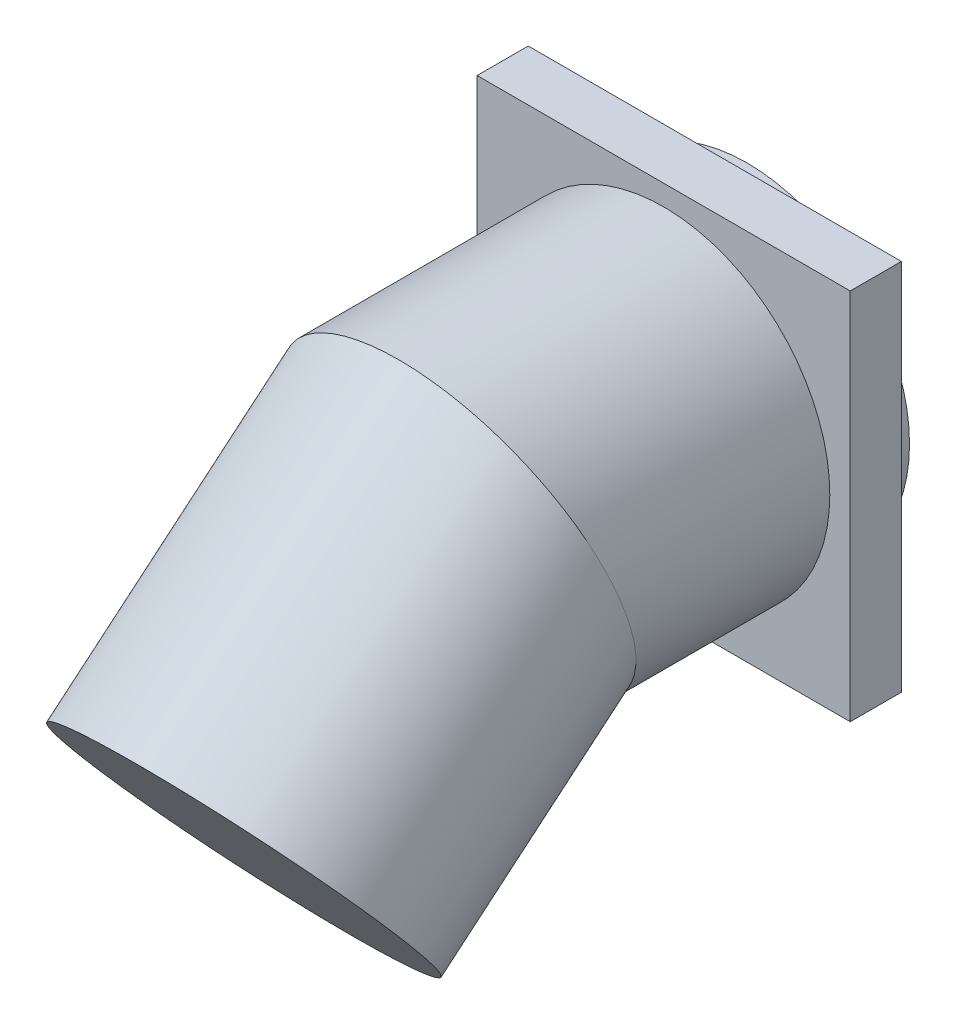
ISO-10303-21;
HEADER;
FILE_DESCRIPTION(('STEP AP214'),'2;1');
FILE_NAME('part.step','',(''),(''),'','','');
FILE_SCHEMA(('AUTOMOTIVE_DESIGN { 1 0 10303 214 1 1 1 1 }'));
ENDSEC;
DATA;
#1=APPLICATION_CONTEXT('core data for automotive mechanical design processes');
#2=APPLICATION_PROTOCOL_DEFINITION('international standard','automotive_design',2000,#1);
#3=PRODUCT_CONTEXT('',#1,'mechanical');
#4=PRODUCT('Part','Part','',(#3));
#5=PRODUCT_RELATED_PRODUCT_CATEGORY('part','',(#4));
#6=PRODUCT_DEFINITION_FORMATION('','',#4);
#7=PRODUCT_DEFINITION_CONTEXT('part definition',#1,'design');
#8=PRODUCT_DEFINITION('design','',#6,#7);
#9=PRODUCT_DEFINITION_SHAPE('','',#8);
#10=(LENGTH_UNIT() NAMED_UNIT(*) SI_UNIT(.MILLI.,.METRE.));
#11=(NAMED_UNIT(*) PLANE_ANGLE_UNIT() SI_UNIT($,.RADIAN.));
#12=(NAMED_UNIT(*) SI_UNIT($,.STERADIAN.) SOLID_ANGLE_UNIT());
#13=UNCERTAINTY_MEASURE_WITH_UNIT(LENGTH_MEASURE(1.E-05),#10,'distance_accuracy_value','');
#14=(GEOMETRIC_REPRESENTATION_CONTEXT(3) GLOBAL_UNCERTAINTY_ASSIGNED_CONTEXT((#13)) GLOBAL_UNIT_ASSIGNED_CONTEXT((#10,
#11,#12)) REPRESENTATION_CONTEXT('',''));
#15=CARTESIAN_POINT('',(0.,0.,0.));
#16=DIRECTION('',(0.,0.,1.));
#17=DIRECTION('',(1.,0.,0.));
#18=AXIS2_PLACEMENT_3D('',#15,#16,#17);
#19=CARTESIAN_POINT('',(-73.,73.,20.));
#20=DIRECTION('',(1.,0.,0.));
#21=DIRECTION('',(0.,1.,0.));
#22=AXIS2_PLACEMENT_3D('',#19,#20,#21);
#23=PLANE('',#22);
#24=DIRECTION('',(0.,-1.,0.));
#25=VECTOR('',#24,1.);
#26=CARTESIAN_POINT('',(-73.,73.,0.));
#27=LINE('',#26,#25);
#28=CARTESIAN_POINT('',(-73.,73.,0.));
#29=VERTEX_POINT('',#28);
#30=CARTESIAN_POINT('',(-73.,-73.,0.));
#31=VERTEX_POINT('',#30);
#32=EDGE_CURVE('E100',#29,#31,#27,.T.);
#33=ORIENTED_EDGE('',*,*,#32,.T.);
#34=DIRECTION('',(0.,0.,-1.));
#35=VECTOR('',#34,1.);
#36=CARTESIAN_POINT('',(-73.,-73.,20.));
#37=LINE('',#36,#35);
#38=CARTESIAN_POINT('',(-73.,-73.,20.));
#39=VERTEX_POINT('',#38);
#40=EDGE_CURVE('E36',#39,#31,#37,.T.);
#41=ORIENTED_EDGE('',*,*,#40,.F.);
#42=DIRECTION('',(0.,-1.,0.));
#43=VECTOR('',#42,1.);
#44=CARTESIAN_POINT('',(-73.,73.,20.));
#45=LINE('',#44,#43);
#46=CARTESIAN_POINT('',(-73.,73.,20.));
#47=VERTEX_POINT('',#46);
#48=EDGE_CURVE('E87',#47,#39,#45,.T.);
#49=ORIENTED_EDGE('',*,*,#48,.F.);
#50=DIRECTION('',(0.,0.,-1.));
#51=VECTOR('',#50,1.);
#52=CARTESIAN_POINT('',(-73.,73.,20.));
#53=LINE('',#52,#51);
#54=EDGE_CURVE('E96',#47,#29,#53,.T.);
#55=ORIENTED_EDGE('',*,*,#54,.T.);
#56=EDGE_LOOP('',(#33,#41,#49,#55));
#57=FACE_BOUND('',#56,.T.);
#58=ADVANCED_FACE('F33',(#57),#23,.F.);
#59=CARTESIAN_POINT('',(-73.,-73.,20.));
#60=DIRECTION('',(0.,1.,0.));
#61=DIRECTION('',(0.,0.,1.));
#62=AXIS2_PLACEMENT_3D('',#59,#60,#61);
#63=PLANE('',#62);
#64=DIRECTION('',(1.,0.,0.));
#65=VECTOR('',#64,1.);
#66=CARTESIAN_POINT('',(-73.,-73.,0.));
#67=LINE('',#66,#65);
#68=CARTESIAN_POINT('',(73.,-73.,0.));
#69=VERTEX_POINT('',#68);
#70=EDGE_CURVE('E92',#31,#69,#67,.T.);
#71=ORIENTED_EDGE('',*,*,#70,.T.);
#72=DIRECTION('',(0.,0.,-1.));
#73=VECTOR('',#72,1.);
#74=CARTESIAN_POINT('',(73.,-73.,20.));
#75=LINE('',#74,#73);
#76=CARTESIAN_POINT('',(73.,-73.,20.));
#77=VERTEX_POINT('',#76);
#78=EDGE_CURVE('E90',#77,#69,#75,.T.);
#79=ORIENTED_EDGE('',*,*,#78,.F.);
#80=DIRECTION('',(1.,0.,0.));
#81=VECTOR('',#80,1.);
#82=CARTESIAN_POINT('',(-73.,-73.,20.));
#83=LINE('',#82,#81);
#84=EDGE_CURVE('E82',#39,#77,#83,.T.);
#85=ORIENTED_EDGE('',*,*,#84,.F.);
#86=ORIENTED_EDGE('',*,*,#40,.T.);
#87=EDGE_LOOP('',(#71,#79,#85,#86));
#88=FACE_BOUND('',#87,.T.);
#89=ADVANCED_FACE('F91',(#88),#63,.F.);
#90=CARTESIAN_POINT('',(73.,73.,20.));
#91=DIRECTION('',(-1.,0.,0.));
#92=DIRECTION('',(0.,-1.,0.));
#93=AXIS2_PLACEMENT_3D('',#90,#91,#92);
#94=PLANE('',#93);
#95=DIRECTION('',(0.,1.,0.));
#96=VECTOR('',#95,1.);
#97=CARTESIAN_POINT('',(73.,73.,0.));
#98=LINE('',#97,#96);
#99=CARTESIAN_POINT('',(73.,73.,0.));
#100=VERTEX_POINT('',#99);
#101=EDGE_CURVE('E68',#69,#100,#98,.T.);
#102=ORIENTED_EDGE('',*,*,#101,.T.);
#103=DIRECTION('',(0.,0.,-1.));
#104=VECTOR('',#103,1.);
#105=CARTESIAN_POINT('',(73.,73.,20.));
#106=LINE('',#105,#104);
#107=CARTESIAN_POINT('',(73.,73.,20.));
#108=VERTEX_POINT('',#107);
#109=EDGE_CURVE('E93',#108,#100,#106,.T.);
#110=ORIENTED_EDGE('',*,*,#109,.F.);
#111=DIRECTION('',(0.,1.,0.));
#112=VECTOR('',#111,1.);
#113=CARTESIAN_POINT('',(73.,73.,20.));
#114=LINE('',#113,#112);
#115=EDGE_CURVE('E85',#77,#108,#114,.T.);
#116=ORIENTED_EDGE('',*,*,#115,.F.);
#117=ORIENTED_EDGE('',*,*,#78,.T.);
#118=EDGE_LOOP('',(#102,#110,#116,#117));
#119=FACE_BOUND('',#118,.T.);
#120=ADVANCED_FACE('F94',(#119),#94,.F.);
#121=CARTESIAN_POINT('',(-73.,73.,20.));
#122=DIRECTION('',(0.,-1.,0.));
#123=DIRECTION('',(0.,0.,-1.));
#124=AXIS2_PLACEMENT_3D('',#121,#122,#123);
#125=PLANE('',#124);
#126=DIRECTION('',(-1.,0.,0.));
#127=VECTOR('',#126,1.);
#128=CARTESIAN_POINT('',(-73.,73.,0.));
#129=LINE('',#128,#127);
#130=EDGE_CURVE('E74',#100,#29,#129,.T.);
#131=ORIENTED_EDGE('',*,*,#130,.T.);
#132=ORIENTED_EDGE('',*,*,#54,.F.);
#133=DIRECTION('',(-1.,0.,0.));
#134=VECTOR('',#133,1.);
#135=CARTESIAN_POINT('',(-73.,73.,20.));
#136=LINE('',#135,#134);
#137=EDGE_CURVE('E51',#108,#47,#136,.T.);
#138=ORIENTED_EDGE('',*,*,#137,.F.);
#139=ORIENTED_EDGE('',*,*,#109,.T.);
#140=EDGE_LOOP('',(#131,#132,#138,#139));
#141=FACE_BOUND('',#140,.T.);
#142=ADVANCED_FACE('F108',(#141),#125,.F.);
#143=CARTESIAN_POINT('',(0.,0.,20.));
#144=DIRECTION('',(0.,0.,1.));
#145=DIRECTION('',(1.,0.,0.));
#146=AXIS2_PLACEMENT_3D('',#143,#144,#145);
#147=PLANE('',#146);
#148=CARTESIAN_POINT('',(0.,0.,20.));
#149=DIRECTION('',(0.,0.,1.));
#150=DIRECTION('',(1.,0.,0.));
#151=AXIS2_PLACEMENT_3D('',#148,#149,#150);
#152=CIRCLE('',#151,65.);
#153=CARTESIAN_POINT('',(65.,0.,20.));
#154=VERTEX_POINT('',#153);
#155=EDGE_CURVE('E11',#154,#154,#152,.T.);
#156=ORIENTED_EDGE('',*,*,#155,.F.);
#157=EDGE_LOOP('',(#156));
#158=FACE_BOUND('',#157,.T.);
#159=ORIENTED_EDGE('',*,*,#48,.T.);
#160=ORIENTED_EDGE('',*,*,#84,.T.);
#161=ORIENTED_EDGE('',*,*,#115,.T.);
#162=ORIENTED_EDGE('',*,*,#137,.T.);
#163=EDGE_LOOP('',(#159,#160,#161,#162));
#164=FACE_BOUND('',#163,.T.);
#165=ADVANCED_FACE('F83',(#158,#164),#147,.T.);
#166=CARTESIAN_POINT('',(0.,0.,0.));
#167=DIRECTION('',(0.,0.,1.));
#168=DIRECTION('',(1.,0.,0.));
#169=AXIS2_PLACEMENT_3D('',#166,#167,#168);
#170=PLANE('',#169);
#171=CARTESIAN_POINT('',(0.,0.,0.));
#172=DIRECTION('',(0.,0.,-1.));
#173=DIRECTION('',(-1.,0.,0.));
#174=AXIS2_PLACEMENT_3D('',#171,#172,#173);
#175=CIRCLE('',#174,63.5);
#176=CARTESIAN_POINT('',(-63.5,0.,0.));
#177=VERTEX_POINT('',#176);
#178=EDGE_CURVE('E42',#177,#177,#175,.T.);
#179=ORIENTED_EDGE('',*,*,#178,.F.);
#180=EDGE_LOOP('',(#179));
#181=FACE_BOUND('',#180,.T.);
#182=ORIENTED_EDGE('',*,*,#32,.F.);
#183=ORIENTED_EDGE('',*,*,#130,.F.);
#184=ORIENTED_EDGE('',*,*,#101,.F.);
#185=ORIENTED_EDGE('',*,*,#70,.F.);
#186=EDGE_LOOP('',(#182,#183,#184,#185));
#187=FACE_BOUND('',#186,.T.);
#188=ADVANCED_FACE('F111',(#181,#187),#170,.F.);
#189=CARTESIAN_POINT('',(0.,0.,-12.7));
#190=DIRECTION('',(0.,0.,1.));
#191=DIRECTION('',(1.,0.,0.));
#192=AXIS2_PLACEMENT_3D('',#189,#190,#191);
#193=CYLINDRICAL_SURFACE('',#192,63.5);
#194=CARTESIAN_POINT('',(0.,0.,-12.7));
#195=DIRECTION('',(0.,0.,-1.));
#196=DIRECTION('',(-1.,0.,0.));
#197=AXIS2_PLACEMENT_3D('',#194,#195,#196);
#198=CIRCLE('',#197,63.5);
#199=CARTESIAN_POINT('',(-63.5,0.,-12.7));
#200=VERTEX_POINT('',#199);
#201=EDGE_CURVE('E103',#200,#200,#198,.T.);
#202=ORIENTED_EDGE('',*,*,#201,.F.);
#203=EDGE_LOOP('',(#202));
#204=FACE_BOUND('',#203,.T.);
#205=ORIENTED_EDGE('',*,*,#178,.T.);
#206=EDGE_LOOP('',(#205));
#207=FACE_BOUND('',#206,.T.);
#208=ADVANCED_FACE('F140',(#204,#207),#193,.T.);
#209=CARTESIAN_POINT('',(0.,0.,-12.7));
#210=DIRECTION('',(0.,0.,-1.));
#211=DIRECTION('',(-1.,0.,0.));
#212=AXIS2_PLACEMENT_3D('',#209,#210,#211);
#213=PLANE('',#212);
#214=ORIENTED_EDGE('',*,*,#201,.T.);
#215=EDGE_LOOP('',(#214));
#216=FACE_BOUND('',#215,.T.);
#217=ADVANCED_FACE('F135',(#216),#213,.T.);
#218=CARTESIAN_POINT('',(0.,-70.7066370655195,184.264888743087));
#219=DIRECTION('',(0.,-0.642787609686541,0.766044443118977));
#220=DIRECTION('',(1.,0.,0.));
#221=AXIS2_PLACEMENT_3D('',#218,#219,#220);
#222=PLANE('',#221);
#223=CARTESIAN_POINT('',(0.,-70.7066370655195,184.264888743087));
#224=DIRECTION('',(0.,-0.642787609686541,0.766044443118977));
#225=DIRECTION('',(1.,0.,0.));
#226=AXIS2_PLACEMENT_3D('',#223,#224,#225);
#227=CIRCLE('',#226,65.);
#228=CARTESIAN_POINT('',(65.,-70.7066370655195,184.264888743087));
#229=VERTEX_POINT('',#228);
#230=EDGE_CURVE('E119',#229,#229,#227,.T.);
#231=ORIENTED_EDGE('',*,*,#230,.T.);
#232=EDGE_LOOP('',(#231));
#233=FACE_BOUND('',#232,.T.);
#234=ADVANCED_FACE('F130',(#233),#222,.T.);
#235=CARTESIAN_POINT('',(0.,33.519923394955,60.0525108705799));
#236=DIRECTION('',(0.,-0.642787609686541,0.766044443118977));
#237=DIRECTION('',(0.,-0.766044443118977,-0.642787609686541));
#238=AXIS2_PLACEMENT_3D('',#235,#236,#237);
#239=CYLINDRICAL_SURFACE('',#238,65.);
#240=CARTESIAN_POINT('',(0.,0.,100.));
#241=DIRECTION('',(0.,-0.34202014332567,0.939692620785908));
#242=DIRECTION('',(0.,0.939692620785908,0.34202014332567));
#243=AXIS2_PLACEMENT_3D('',#240,#241,#242);
#244=ELLIPSE('',#243,69.1715552109343,65.);
#245=CARTESIAN_POINT('',(0.,65.,123.658065227303));
#246=VERTEX_POINT('',#245);
#247=EDGE_CURVE('E118',#246,#246,#244,.F.);
#248=ORIENTED_EDGE('',*,*,#247,.F.);
#249=EDGE_LOOP('',(#248));
#250=FACE_BOUND('',#249,.T.);
#251=ORIENTED_EDGE('',*,*,#230,.F.);
#252=EDGE_LOOP('',(#251));
#253=FACE_BOUND('',#252,.T.);
#254=ADVANCED_FACE('F127',(#250,#253),#239,.T.);
#255=CARTESIAN_POINT('',(0.,0.,20.));
#256=DIRECTION('',(0.,0.,1.));
#257=DIRECTION('',(1.,0.,0.));
#258=AXIS2_PLACEMENT_3D('',#255,#256,#257);
#259=CYLINDRICAL_SURFACE('',#258,65.);
#260=ORIENTED_EDGE('',*,*,#155,.T.);
#261=EDGE_LOOP('',(#260));
#262=FACE_BOUND('',#261,.T.);
#263=ORIENTED_EDGE('',*,*,#247,.T.);
#264=EDGE_LOOP('',(#263));
#265=FACE_BOUND('',#264,.T.);
#266=ADVANCED_FACE('F125',(#262,#265),#259,.T.);
#267=CLOSED_SHELL('',(#58,#89,#120,#142,#165,#188,#208,#217,#234,#254,#266));
#268=MANIFOLD_SOLID_BREP('B2',#267);
#269=ADVANCED_BREP_SHAPE_REPRESENTATION('',(#18,#268),#14);
#270=SHAPE_DEFINITION_REPRESENTATION(#9,#269);
ENDSEC;
END-ISO-10303-21;
